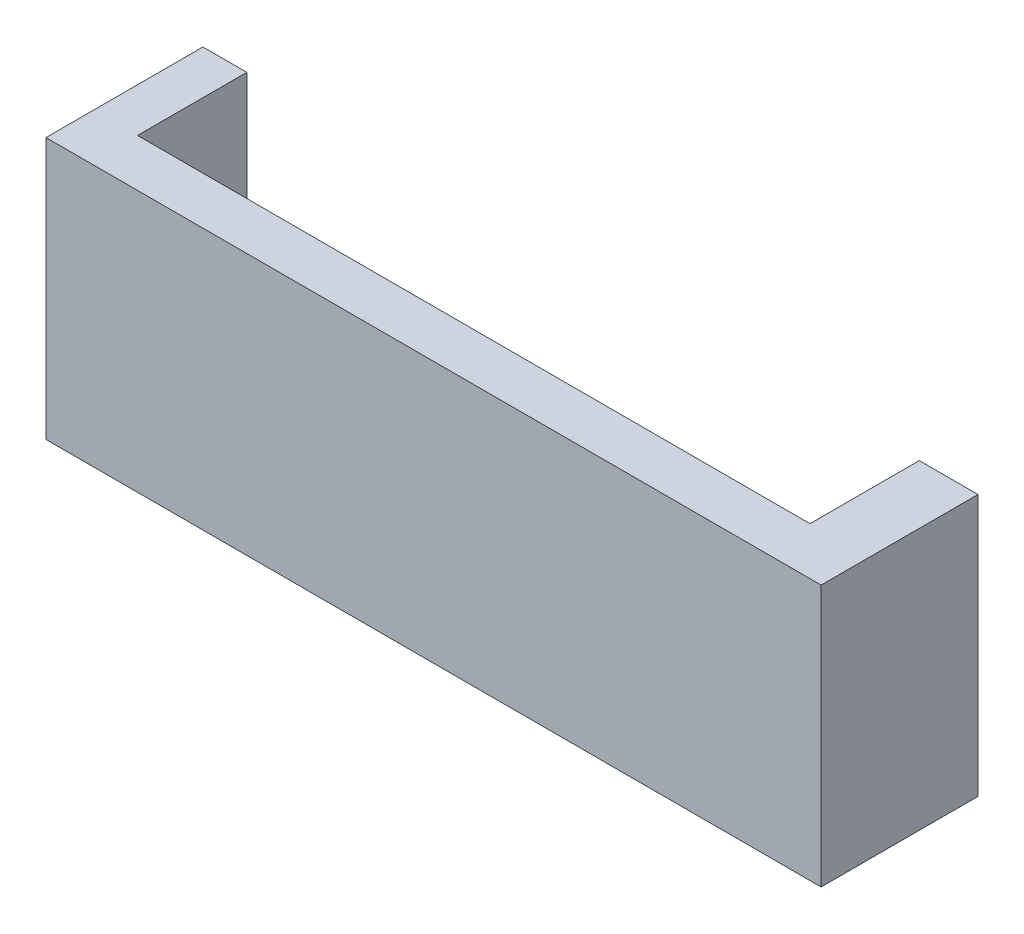
ISO-10303-21;
HEADER;
FILE_DESCRIPTION(('STEP AP214'),'2;1');
FILE_NAME('part.step','',(''),(''),'','','');
FILE_SCHEMA(('AUTOMOTIVE_DESIGN { 1 0 10303 214 1 1 1 1 }'));
ENDSEC;
DATA;
#1=APPLICATION_CONTEXT('core data for automotive mechanical design processes');
#2=APPLICATION_PROTOCOL_DEFINITION('international standard','automotive_design',2000,#1);
#3=PRODUCT_CONTEXT('',#1,'mechanical');
#4=PRODUCT('Part','Part','',(#3));
#5=PRODUCT_RELATED_PRODUCT_CATEGORY('part','',(#4));
#6=PRODUCT_DEFINITION_FORMATION('','',#4);
#7=PRODUCT_DEFINITION_CONTEXT('part definition',#1,'design');
#8=PRODUCT_DEFINITION('design','',#6,#7);
#9=PRODUCT_DEFINITION_SHAPE('','',#8);
#10=(LENGTH_UNIT() NAMED_UNIT(*) SI_UNIT(.MILLI.,.METRE.));
#11=(NAMED_UNIT(*) PLANE_ANGLE_UNIT() SI_UNIT($,.RADIAN.));
#12=(NAMED_UNIT(*) SI_UNIT($,.STERADIAN.) SOLID_ANGLE_UNIT());
#13=UNCERTAINTY_MEASURE_WITH_UNIT(LENGTH_MEASURE(1.E-05),#10,'distance_accuracy_value','');
#14=(GEOMETRIC_REPRESENTATION_CONTEXT(3) GLOBAL_UNCERTAINTY_ASSIGNED_CONTEXT((#13)) GLOBAL_UNIT_ASSIGNED_CONTEXT((#10,
#11,#12)) REPRESENTATION_CONTEXT('',''));
#15=CARTESIAN_POINT('',(0.,0.,0.));
#16=DIRECTION('',(0.,0.,1.));
#17=DIRECTION('',(1.,0.,0.));
#18=AXIS2_PLACEMENT_3D('',#15,#16,#17);
#19=CARTESIAN_POINT('',(-415.,-115.,-95.));
#20=DIRECTION('',(0.,-1.,0.));
#21=DIRECTION('',(0.,0.,-1.));
#22=AXIS2_PLACEMENT_3D('',#19,#20,#21);
#23=PLANE('',#22);
#24=DIRECTION('',(0.,0.,1.));
#25=VECTOR('',#24,1.);
#26=CARTESIAN_POINT('',(207.5,-115.,53.));
#27=LINE('',#26,#25);
#28=CARTESIAN_POINT('',(207.5,-115.,53.));
#29=VERTEX_POINT('',#28);
#30=CARTESIAN_POINT('',(207.5,-115.,95.));
#31=VERTEX_POINT('',#30);
#32=EDGE_CURVE('E55',#29,#31,#27,.T.);
#33=ORIENTED_EDGE('',*,*,#32,.F.);
#34=DIRECTION('',(-1.,0.,0.));
#35=VECTOR('',#34,1.);
#36=CARTESIAN_POINT('',(415.,-115.,53.));
#37=LINE('',#36,#35);
#38=CARTESIAN_POINT('',(219.259228355375,-115.,53.));
#39=VERTEX_POINT('',#38);
#40=EDGE_CURVE('E115',#39,#29,#37,.T.);
#41=ORIENTED_EDGE('',*,*,#40,.F.);
#42=DIRECTION('',(0.,0.,1.));
#43=VECTOR('',#42,1.);
#44=CARTESIAN_POINT('',(219.259228355375,-115.,0.));
#45=LINE('',#44,#43);
#46=CARTESIAN_POINT('',(219.259228355375,-115.,82.2517643619484));
#47=VERTEX_POINT('',#46);
#48=EDGE_CURVE('E169',#39,#47,#45,.T.);
#49=ORIENTED_EDGE('',*,*,#48,.T.);
#50=DIRECTION('',(1.,0.,0.));
#51=VECTOR('',#50,1.);
#52=CARTESIAN_POINT('',(0.,-115.,82.2517643619484));
#53=LINE('',#52,#51);
#54=CARTESIAN_POINT('',(399.273614281384,-115.,82.2517643619484));
#55=VERTEX_POINT('',#54);
#56=EDGE_CURVE('E162',#47,#55,#53,.T.);
#57=ORIENTED_EDGE('',*,*,#56,.T.);
#58=DIRECTION('',(0.,0.,1.));
#59=VECTOR('',#58,1.);
#60=CARTESIAN_POINT('',(399.273614281384,-115.,0.));
#61=LINE('',#60,#59);
#62=CARTESIAN_POINT('',(399.273614281384,-115.,53.));
#63=VERTEX_POINT('',#62);
#64=EDGE_CURVE('E160',#63,#55,#61,.T.);
#65=ORIENTED_EDGE('',*,*,#64,.F.);
#66=CARTESIAN_POINT('',(415.,-115.,53.));
#67=VERTEX_POINT('',#66);
#68=EDGE_CURVE('E122',#67,#63,#37,.T.);
#69=ORIENTED_EDGE('',*,*,#68,.F.);
#70=DIRECTION('',(0.,0.,1.));
#71=VECTOR('',#70,1.);
#72=CARTESIAN_POINT('',(415.,-115.,-95.));
#73=LINE('',#72,#71);
#74=CARTESIAN_POINT('',(415.,-115.,95.));
#75=VERTEX_POINT('',#74);
#76=EDGE_CURVE('E48',#67,#75,#73,.T.);
#77=ORIENTED_EDGE('',*,*,#76,.T.);
#78=DIRECTION('',(1.,0.,0.));
#79=VECTOR('',#78,1.);
#80=CARTESIAN_POINT('',(-415.,-115.,95.));
#81=LINE('',#80,#79);
#82=EDGE_CURVE('E117',#31,#75,#81,.T.);
#83=ORIENTED_EDGE('',*,*,#82,.F.);
#84=EDGE_LOOP('',(#33,#41,#49,#57,#65,#69,#77,#83));
#85=FACE_BOUND('',#84,.T.);
#86=ADVANCED_FACE('F40',(#85),#23,.T.);
#87=CARTESIAN_POINT('',(0.,0.,53.));
#88=DIRECTION('',(0.,0.,-1.));
#89=DIRECTION('',(-1.,0.,0.));
#90=AXIS2_PLACEMENT_3D('',#87,#88,#89);
#91=PLANE('',#90);
#92=DIRECTION('',(0.,1.,0.));
#93=VECTOR('',#92,1.);
#94=CARTESIAN_POINT('',(207.5,-115.,53.));
#95=LINE('',#94,#93);
#96=CARTESIAN_POINT('',(207.5,-45.0000000000001,53.));
#97=VERTEX_POINT('',#96);
#98=EDGE_CURVE('E102',#29,#97,#95,.T.);
#99=ORIENTED_EDGE('',*,*,#98,.T.);
#100=DIRECTION('',(-1.,0.,0.));
#101=VECTOR('',#100,1.);
#102=CARTESIAN_POINT('',(0.,-45.,53.));
#103=LINE('',#102,#101);
#104=CARTESIAN_POINT('',(219.259228355375,-45.,53.));
#105=VERTEX_POINT('',#104);
#106=EDGE_CURVE('E149',#105,#97,#103,.T.);
#107=ORIENTED_EDGE('',*,*,#106,.F.);
#108=DIRECTION('',(0.,-1.,0.));
#109=VECTOR('',#108,1.);
#110=CARTESIAN_POINT('',(219.259228355375,-45.,53.));
#111=LINE('',#110,#109);
#112=EDGE_CURVE('E121',#105,#39,#111,.T.);
#113=ORIENTED_EDGE('',*,*,#112,.T.);
#114=ORIENTED_EDGE('',*,*,#40,.T.);
#115=EDGE_LOOP('',(#99,#107,#113,#114));
#116=FACE_BOUND('',#115,.T.);
#117=ADVANCED_FACE('F120',(#116),#91,.T.);
#118=CARTESIAN_POINT('',(0.,-45.,97.));
#119=DIRECTION('',(0.,-1.,0.));
#120=DIRECTION('',(1.,0.,0.));
#121=AXIS2_PLACEMENT_3D('',#118,#119,#120);
#122=PLANE('',#121);
#123=ORIENTED_EDGE('',*,*,#106,.T.);
#124=DIRECTION('',(0.,0.,1.));
#125=VECTOR('',#124,1.);
#126=CARTESIAN_POINT('',(207.5,-45.0000000000001,53.));
#127=LINE('',#126,#125);
#128=CARTESIAN_POINT('',(207.5,-45.0000000000001,95.));
#129=VERTEX_POINT('',#128);
#130=EDGE_CURVE('E105',#97,#129,#127,.T.);
#131=ORIENTED_EDGE('',*,*,#130,.T.);
#132=DIRECTION('',(-1.,0.,0.));
#133=VECTOR('',#132,1.);
#134=CARTESIAN_POINT('',(0.,-45.,95.));
#135=LINE('',#134,#133);
#136=CARTESIAN_POINT('',(415.,-45.,95.));
#137=VERTEX_POINT('',#136);
#138=EDGE_CURVE('E126',#137,#129,#135,.T.);
#139=ORIENTED_EDGE('',*,*,#138,.F.);
#140=DIRECTION('',(0.,0.,-1.));
#141=VECTOR('',#140,1.);
#142=CARTESIAN_POINT('',(415.,-45.,97.));
#143=LINE('',#142,#141);
#144=CARTESIAN_POINT('',(415.,-45.,53.));
#145=VERTEX_POINT('',#144);
#146=EDGE_CURVE('E145',#137,#145,#143,.T.);
#147=ORIENTED_EDGE('',*,*,#146,.T.);
#148=CARTESIAN_POINT('',(399.273614281384,-45.,53.));
#149=VERTEX_POINT('',#148);
#150=EDGE_CURVE('E151',#145,#149,#103,.T.);
#151=ORIENTED_EDGE('',*,*,#150,.T.);
#152=DIRECTION('',(0.,0.,1.));
#153=VECTOR('',#152,1.);
#154=CARTESIAN_POINT('',(399.273614281384,-45.,0.));
#155=LINE('',#154,#153);
#156=CARTESIAN_POINT('',(399.273614281384,-45.,82.2517643619484));
#157=VERTEX_POINT('',#156);
#158=EDGE_CURVE('E165',#149,#157,#155,.T.);
#159=ORIENTED_EDGE('',*,*,#158,.T.);
#160=DIRECTION('',(1.,0.,0.));
#161=VECTOR('',#160,1.);
#162=CARTESIAN_POINT('',(0.,-45.,82.2517643619484));
#163=LINE('',#162,#161);
#164=CARTESIAN_POINT('',(219.259228355375,-45.,82.2517643619484));
#165=VERTEX_POINT('',#164);
#166=EDGE_CURVE('E168',#165,#157,#163,.T.);
#167=ORIENTED_EDGE('',*,*,#166,.F.);
#168=DIRECTION('',(0.,0.,1.));
#169=VECTOR('',#168,1.);
#170=CARTESIAN_POINT('',(219.259228355375,-45.,0.));
#171=LINE('',#170,#169);
#172=EDGE_CURVE('E171',#105,#165,#171,.T.);
#173=ORIENTED_EDGE('',*,*,#172,.F.);
#174=EDGE_LOOP('',(#123,#131,#139,#147,#151,#159,#167,#173));
#175=FACE_BOUND('',#174,.T.);
#176=ADVANCED_FACE('F158',(#175),#122,.F.);
#177=CARTESIAN_POINT('',(415.,-115.,-95.));
#178=DIRECTION('',(1.,0.,0.));
#179=DIRECTION('',(0.,0.,-1.));
#180=AXIS2_PLACEMENT_3D('',#177,#178,#179);
#181=PLANE('',#180);
#182=ORIENTED_EDGE('',*,*,#146,.F.);
#183=DIRECTION('',(0.,1.,0.));
#184=VECTOR('',#183,1.);
#185=CARTESIAN_POINT('',(415.,-115.,95.));
#186=LINE('',#185,#184);
#187=EDGE_CURVE('E132',#75,#137,#186,.T.);
#188=ORIENTED_EDGE('',*,*,#187,.F.);
#189=ORIENTED_EDGE('',*,*,#76,.F.);
#190=DIRECTION('',(0.,-1.,0.));
#191=VECTOR('',#190,1.);
#192=CARTESIAN_POINT('',(415.,115.,53.));
#193=LINE('',#192,#191);
#194=EDGE_CURVE('E123',#145,#67,#193,.T.);
#195=ORIENTED_EDGE('',*,*,#194,.F.);
#196=EDGE_LOOP('',(#182,#188,#189,#195));
#197=FACE_BOUND('',#196,.T.);
#198=ADVANCED_FACE('F144',(#197),#181,.T.);
#199=CARTESIAN_POINT('',(0.,0.,95.));
#200=DIRECTION('',(0.,0.,-1.));
#201=DIRECTION('',(-1.,0.,0.));
#202=AXIS2_PLACEMENT_3D('',#199,#200,#201);
#203=PLANE('',#202);
#204=ORIENTED_EDGE('',*,*,#138,.T.);
#205=DIRECTION('',(0.,-1.,0.));
#206=VECTOR('',#205,1.);
#207=CARTESIAN_POINT('',(207.5,0.,95.));
#208=LINE('',#207,#206);
#209=EDGE_CURVE('E12',#129,#31,#208,.T.);
#210=ORIENTED_EDGE('',*,*,#209,.T.);
#211=ORIENTED_EDGE('',*,*,#82,.T.);
#212=ORIENTED_EDGE('',*,*,#187,.T.);
#213=EDGE_LOOP('',(#204,#210,#211,#212));
#214=FACE_BOUND('',#213,.T.);
#215=ADVANCED_FACE('F42',(#214),#203,.F.);
#216=DIRECTION('',(0.,-1.,0.));
#217=VECTOR('',#216,1.);
#218=CARTESIAN_POINT('',(399.273614281384,-45.,53.));
#219=LINE('',#218,#217);
#220=EDGE_CURVE('E156',#149,#63,#219,.T.);
#221=ORIENTED_EDGE('',*,*,#220,.F.);
#222=ORIENTED_EDGE('',*,*,#150,.F.);
#223=ORIENTED_EDGE('',*,*,#194,.T.);
#224=ORIENTED_EDGE('',*,*,#68,.T.);
#225=EDGE_LOOP('',(#221,#222,#223,#224));
#226=FACE_BOUND('',#225,.T.);
#227=ADVANCED_FACE('F181',(#226),#91,.T.);
#228=CARTESIAN_POINT('',(219.259228355375,-45.,0.));
#229=DIRECTION('',(1.,0.,0.));
#230=DIRECTION('',(0.,0.,-1.));
#231=AXIS2_PLACEMENT_3D('',#228,#229,#230);
#232=PLANE('',#231);
#233=ORIENTED_EDGE('',*,*,#48,.F.);
#234=ORIENTED_EDGE('',*,*,#112,.F.);
#235=ORIENTED_EDGE('',*,*,#172,.T.);
#236=DIRECTION('',(0.,-1.,0.));
#237=VECTOR('',#236,1.);
#238=CARTESIAN_POINT('',(219.259228355375,-45.,82.2517643619484));
#239=LINE('',#238,#237);
#240=EDGE_CURVE('E153',#165,#47,#239,.T.);
#241=ORIENTED_EDGE('',*,*,#240,.T.);
#242=EDGE_LOOP('',(#233,#234,#235,#241));
#243=FACE_BOUND('',#242,.T.);
#244=ADVANCED_FACE('F186',(#243),#232,.T.);
#245=CARTESIAN_POINT('',(0.,-45.,82.2517643619484));
#246=DIRECTION('',(0.,0.,-1.));
#247=DIRECTION('',(-1.,0.,0.));
#248=AXIS2_PLACEMENT_3D('',#245,#246,#247);
#249=PLANE('',#248);
#250=ORIENTED_EDGE('',*,*,#56,.F.);
#251=ORIENTED_EDGE('',*,*,#240,.F.);
#252=ORIENTED_EDGE('',*,*,#166,.T.);
#253=DIRECTION('',(0.,-1.,0.));
#254=VECTOR('',#253,1.);
#255=CARTESIAN_POINT('',(399.273614281384,-45.,82.2517643619484));
#256=LINE('',#255,#254);
#257=EDGE_CURVE('E62',#157,#55,#256,.T.);
#258=ORIENTED_EDGE('',*,*,#257,.T.);
#259=EDGE_LOOP('',(#250,#251,#252,#258));
#260=FACE_BOUND('',#259,.T.);
#261=ADVANCED_FACE('F184',(#260),#249,.T.);
#262=CARTESIAN_POINT('',(399.273614281384,-45.,0.));
#263=DIRECTION('',(1.,0.,0.));
#264=DIRECTION('',(0.,0.,-1.));
#265=AXIS2_PLACEMENT_3D('',#262,#263,#264);
#266=PLANE('',#265);
#267=ORIENTED_EDGE('',*,*,#64,.T.);
#268=ORIENTED_EDGE('',*,*,#257,.F.);
#269=ORIENTED_EDGE('',*,*,#158,.F.);
#270=ORIENTED_EDGE('',*,*,#220,.T.);
#271=EDGE_LOOP('',(#267,#268,#269,#270));
#272=FACE_BOUND('',#271,.T.);
#273=ADVANCED_FACE('F179',(#272),#266,.F.);
#274=CARTESIAN_POINT('',(207.5,-115.,53.));
#275=DIRECTION('',(1.,0.,0.));
#276=DIRECTION('',(0.,0.,-1.));
#277=AXIS2_PLACEMENT_3D('',#274,#275,#276);
#278=PLANE('',#277);
#279=ORIENTED_EDGE('',*,*,#130,.F.);
#280=ORIENTED_EDGE('',*,*,#98,.F.);
#281=ORIENTED_EDGE('',*,*,#32,.T.);
#282=ORIENTED_EDGE('',*,*,#209,.F.);
#283=EDGE_LOOP('',(#279,#280,#281,#282));
#284=FACE_BOUND('',#283,.T.);
#285=ADVANCED_FACE('F103',(#284),#278,.F.);
#286=CLOSED_SHELL('',(#86,#117,#176,#198,#215,#227,#244,#261,#273,#285));
#287=MANIFOLD_SOLID_BREP('B2',#286);
#288=ADVANCED_BREP_SHAPE_REPRESENTATION('',(#18,#287),#14);
#289=SHAPE_DEFINITION_REPRESENTATION(#9,#288);
ENDSEC;
END-ISO-10303-21;
